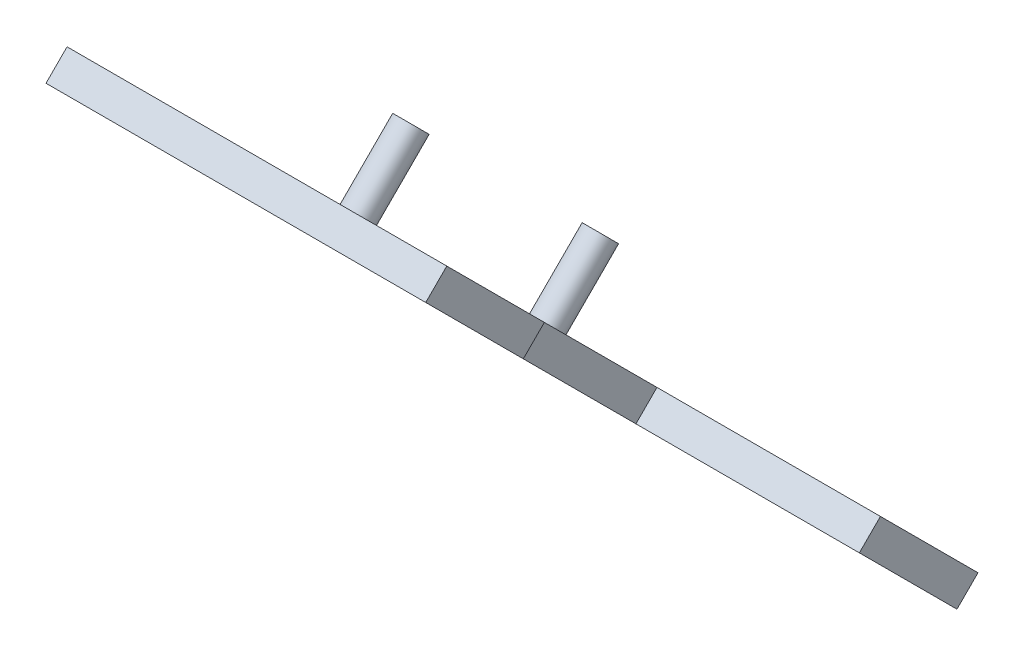
ISO-10303-21;
HEADER;
FILE_DESCRIPTION(('STEP AP214'),'2;1');
FILE_NAME('part.step','',(''),(''),'','','');
FILE_SCHEMA(('AUTOMOTIVE_DESIGN { 1 0 10303 214 1 1 1 1 }'));
ENDSEC;
DATA;
#1=APPLICATION_CONTEXT('core data for automotive mechanical design processes');
#2=APPLICATION_PROTOCOL_DEFINITION('international standard','automotive_design',2000,#1);
#3=PRODUCT_CONTEXT('',#1,'mechanical');
#4=PRODUCT('Part','Part','',(#3));
#5=PRODUCT_RELATED_PRODUCT_CATEGORY('part','',(#4));
#6=PRODUCT_DEFINITION_FORMATION('','',#4);
#7=PRODUCT_DEFINITION_CONTEXT('part definition',#1,'design');
#8=PRODUCT_DEFINITION('design','',#6,#7);
#9=PRODUCT_DEFINITION_SHAPE('','',#8);
#10=(LENGTH_UNIT() NAMED_UNIT(*) SI_UNIT(.MILLI.,.METRE.));
#11=(NAMED_UNIT(*) PLANE_ANGLE_UNIT() SI_UNIT($,.RADIAN.));
#12=(NAMED_UNIT(*) SI_UNIT($,.STERADIAN.) SOLID_ANGLE_UNIT());
#13=UNCERTAINTY_MEASURE_WITH_UNIT(LENGTH_MEASURE(1.E-05),#10,'distance_accuracy_value','');
#14=(GEOMETRIC_REPRESENTATION_CONTEXT(3) GLOBAL_UNCERTAINTY_ASSIGNED_CONTEXT((#13)) GLOBAL_UNIT_ASSIGNED_CONTEXT((#10,
#11,#12)) REPRESENTATION_CONTEXT('',''));
#15=CARTESIAN_POINT('',(0.,0.,0.));
#16=DIRECTION('',(0.,0.,1.));
#17=DIRECTION('',(1.,0.,0.));
#18=AXIS2_PLACEMENT_3D('',#15,#16,#17);
#19=CARTESIAN_POINT('',(-23105.,0.,0.));
#20=DIRECTION('',(1.,0.,0.));
#21=DIRECTION('',(0.,0.,-1.));
#22=AXIS2_PLACEMENT_3D('',#19,#20,#21);
#23=PLANE('',#22);
#24=DIRECTION('',(0.,-0.707106781186514,0.707106781186581));
#25=VECTOR('',#24,1.);
#26=CARTESIAN_POINT('',(-23105.,2719.70909353259,40124.3472603107));
#27=LINE('',#26,#25);
#28=CARTESIAN_POINT('',(-23105.,2719.70909353259,40124.3472603107));
#29=VERTEX_POINT('',#28);
#30=CARTESIAN_POINT('',(-23105.,2705.56695790886,40138.4893959344));
#31=VERTEX_POINT('',#30);
#32=EDGE_CURVE('E106',#29,#31,#27,.T.);
#33=ORIENTED_EDGE('',*,*,#32,.F.);
#34=DIRECTION('',(0.,-0.707106781186554,-0.707106781186542));
#35=VECTOR('',#34,1.);
#36=CARTESIAN_POINT('',(-23105.,-18702.3190833891,18702.3190833894));
#37=LINE('',#36,#35);
#38=CARTESIAN_POINT('',(-23105.,2945.47722462662,40350.1153914047));
#39=VERTEX_POINT('',#38);
#40=EDGE_CURVE('E125',#39,#29,#37,.T.);
#41=ORIENTED_EDGE('',*,*,#40,.F.);
#42=DIRECTION('',(0.,-0.707106781186514,0.707106781186581));
#43=VECTOR('',#42,1.);
#44=CARTESIAN_POINT('',(-23105.,2945.47722462662,40350.1153914047));
#45=LINE('',#44,#43);
#46=CARTESIAN_POINT('',(-23105.,2931.3350890029,40364.2575270285));
#47=VERTEX_POINT('',#46);
#48=EDGE_CURVE('E124',#39,#47,#45,.T.);
#49=ORIENTED_EDGE('',*,*,#48,.T.);
#50=DIRECTION('',(0.,0.707106781186581,0.707106781186514));
#51=VECTOR('',#50,1.);
#52=CARTESIAN_POINT('',(-23105.,-18716.4612190129,18716.4612190147));
#53=LINE('',#52,#51);
#54=EDGE_CURVE('E54',#31,#47,#53,.T.);
#55=ORIENTED_EDGE('',*,*,#54,.F.);
#56=EDGE_LOOP('',(#33,#41,#49,#55));
#57=FACE_BOUND('',#56,.T.);
#58=ADVANCED_FACE('F39',(#57),#23,.T.);
#59=CARTESIAN_POINT('',(-23105.,21713.3554670348,21713.3554670382));
#60=DIRECTION('',(0.,0.707106781186492,0.707106781186603));
#61=DIRECTION('',(0.,-0.707106781186603,0.707106781186492));
#62=AXIS2_PLACEMENT_3D('',#59,#60,#61);
#63=PLANE('',#62);
#64=DIRECTION('',(-1.,0.,0.));
#65=VECTOR('',#64,1.);
#66=CARTESIAN_POINT('',(-23105.,3011.03638364598,40415.6745504241));
#67=LINE('',#66,#65);
#68=CARTESIAN_POINT('',(-22954.8819480886,3011.03638364597,40415.6745504241));
#69=VERTEX_POINT('',#68);
#70=CARTESIAN_POINT('',(-23210.,3011.03638364598,40415.6745504241));
#71=VERTEX_POINT('',#70);
#72=EDGE_CURVE('E62',#69,#71,#67,.T.);
#73=ORIENTED_EDGE('',*,*,#72,.T.);
#74=DIRECTION('',(0.,0.707106781186603,-0.707106781186492));
#75=VECTOR('',#74,1.);
#76=CARTESIAN_POINT('',(-23210.,21713.3554670348,21713.3554670382));
#77=LINE('',#76,#75);
#78=CARTESIAN_POINT('',(-23210.,2996.89424802225,40429.8166860478));
#79=VERTEX_POINT('',#78);
#80=EDGE_CURVE('E150',#79,#71,#77,.T.);
#81=ORIENTED_EDGE('',*,*,#80,.F.);
#82=DIRECTION('',(-1.,0.,0.));
#83=VECTOR('',#82,1.);
#84=CARTESIAN_POINT('',(-23105.,2996.89424802225,40429.8166860478));
#85=LINE('',#84,#83);
#86=CARTESIAN_POINT('',(-22954.8819480886,2996.89424802224,40429.8166860478));
#87=VERTEX_POINT('',#86);
#88=EDGE_CURVE('E11',#87,#79,#85,.T.);
#89=ORIENTED_EDGE('',*,*,#88,.F.);
#90=DIRECTION('',(0.,-0.707106781186514,0.707106781186581));
#91=VECTOR('',#90,1.);
#92=CARTESIAN_POINT('',(-22954.8819480886,3011.03638364597,40415.6745504241));
#93=LINE('',#92,#91);
#94=EDGE_CURVE('E152',#69,#87,#93,.T.);
#95=ORIENTED_EDGE('',*,*,#94,.F.);
#96=EDGE_LOOP('',(#73,#81,#89,#95));
#97=FACE_BOUND('',#96,.T.);
#98=ADVANCED_FACE('F41',(#97),#63,.T.);
#99=CARTESIAN_POINT('',(-23105.,-18716.4612190129,18716.4612190147));
#100=DIRECTION('',(0.,-0.707106781186514,0.707106781186581));
#101=DIRECTION('',(0.,-0.707106781186581,-0.707106781186514));
#102=AXIS2_PLACEMENT_3D('',#99,#100,#101);
#103=PLANE('',#102);
#104=ORIENTED_EDGE('',*,*,#88,.T.);
#105=DIRECTION('',(0.,0.707106781186581,0.707106781186514));
#106=VECTOR('',#105,1.);
#107=CARTESIAN_POINT('',(-23210.,-18716.4612190129,18716.4612190147));
#108=LINE('',#107,#106);
#109=CARTESIAN_POINT('',(-23210.,2640.00779888953,40072.9302369151));
#110=VERTEX_POINT('',#109);
#111=EDGE_CURVE('E148',#110,#79,#108,.T.);
#112=ORIENTED_EDGE('',*,*,#111,.F.);
#113=DIRECTION('',(-1.,0.,0.));
#114=VECTOR('',#113,1.);
#115=CARTESIAN_POINT('',(-23105.,2640.00779888953,40072.9302369151));
#116=LINE('',#115,#114);
#117=CARTESIAN_POINT('',(-22954.8819480886,2640.00779888951,40072.9302369151));
#118=VERTEX_POINT('',#117);
#119=EDGE_CURVE('E47',#118,#110,#116,.T.);
#120=ORIENTED_EDGE('',*,*,#119,.F.);
#121=DIRECTION('',(0.,0.707106781186567,0.707106781186528));
#122=VECTOR('',#121,1.);
#123=CARTESIAN_POINT('',(-22954.8819480886,2705.56695790886,40138.4893959344));
#124=LINE('',#123,#122);
#125=CARTESIAN_POINT('',(-22954.8819480886,2705.56695790886,40138.4893959344));
#126=VERTEX_POINT('',#125);
#127=EDGE_CURVE('E120',#118,#126,#124,.T.);
#128=ORIENTED_EDGE('',*,*,#127,.T.);
#129=DIRECTION('',(-1.,0.,0.));
#130=VECTOR('',#129,1.);
#131=CARTESIAN_POINT('',(-23105.,2705.56695790886,40138.4893959344));
#132=LINE('',#131,#130);
#133=EDGE_CURVE('E108',#126,#31,#132,.T.);
#134=ORIENTED_EDGE('',*,*,#133,.T.);
#135=ORIENTED_EDGE('',*,*,#54,.T.);
#136=DIRECTION('',(1.,0.,0.));
#137=VECTOR('',#136,1.);
#138=CARTESIAN_POINT('',(-23105.,2931.33508900289,40364.2575270285));
#139=LINE('',#138,#137);
#140=CARTESIAN_POINT('',(-22954.8819480886,2931.33508900289,40364.2575270285));
#141=VERTEX_POINT('',#140);
#142=EDGE_CURVE('E164',#47,#141,#139,.T.);
#143=ORIENTED_EDGE('',*,*,#142,.T.);
#144=DIRECTION('',(0.,0.707106781186605,0.70710678118649));
#145=VECTOR('',#144,1.);
#146=CARTESIAN_POINT('',(-22954.8819480886,2996.89424802224,40429.8166860478));
#147=LINE('',#146,#145);
#148=EDGE_CURVE('E161',#141,#87,#147,.T.);
#149=ORIENTED_EDGE('',*,*,#148,.T.);
#150=EDGE_LOOP('',(#104,#112,#120,#128,#134,#135,#143,#149));
#151=FACE_BOUND('',#150,.T.);
#152=ADVANCED_FACE('F118',(#151),#103,.T.);
#153=CARTESIAN_POINT('',(-23105.,21356.4690179023,21356.4690179029));
#154=DIRECTION('',(0.,-0.707106781186536,-0.707106781186559));
#155=DIRECTION('',(0.,0.707106781186559,-0.707106781186536));
#156=AXIS2_PLACEMENT_3D('',#153,#154,#155);
#157=PLANE('',#156);
#158=ORIENTED_EDGE('',*,*,#119,.T.);
#159=DIRECTION('',(0.,-0.707106781186559,0.707106781186536));
#160=VECTOR('',#159,1.);
#161=CARTESIAN_POINT('',(-23210.,21356.4690179023,21356.4690179029));
#162=LINE('',#161,#160);
#163=CARTESIAN_POINT('',(-23210.,2654.14993451326,40058.7881012914));
#164=VERTEX_POINT('',#163);
#165=EDGE_CURVE('E130',#164,#110,#162,.T.);
#166=ORIENTED_EDGE('',*,*,#165,.F.);
#167=DIRECTION('',(-1.,0.,0.));
#168=VECTOR('',#167,1.);
#169=CARTESIAN_POINT('',(-23105.,2654.14993451326,40058.7881012914));
#170=LINE('',#169,#168);
#171=CARTESIAN_POINT('',(-22954.8819480886,2654.14993451324,40058.7881012914));
#172=VERTEX_POINT('',#171);
#173=EDGE_CURVE('E135',#172,#164,#170,.T.);
#174=ORIENTED_EDGE('',*,*,#173,.F.);
#175=DIRECTION('',(0.,-0.707106781186514,0.707106781186581));
#176=VECTOR('',#175,1.);
#177=CARTESIAN_POINT('',(-22954.8819480886,2654.14993451324,40058.7881012914));
#178=LINE('',#177,#176);
#179=EDGE_CURVE('E142',#172,#118,#178,.T.);
#180=ORIENTED_EDGE('',*,*,#179,.T.);
#181=EDGE_LOOP('',(#158,#166,#174,#180));
#182=FACE_BOUND('',#181,.T.);
#183=ADVANCED_FACE('F140',(#182),#157,.T.);
#184=CARTESIAN_POINT('',(-23105.,-18702.3190833891,18702.3190833894));
#185=DIRECTION('',(0.,0.707106781186542,-0.707106781186553));
#186=DIRECTION('',(0.,0.707106781186553,0.707106781186542));
#187=AXIS2_PLACEMENT_3D('',#184,#185,#186);
#188=PLANE('',#187);
#189=CARTESIAN_POINT('',(-23146.2304490389,2879.14180176871,40283.7799685468));
#190=DIRECTION('',(0.,0.707106781186542,-0.707106781186553));
#191=DIRECTION('',(0.,0.707106781186553,0.707106781186542));
#192=AXIS2_PLACEMENT_3D('',#189,#190,#191);
#193=CIRCLE('',#192,10.0000000000037);
#194=CARTESIAN_POINT('',(-23146.2304490389,2886.21286958058,40290.8510363587));
#195=VERTEX_POINT('',#194);
#196=EDGE_CURVE('E179',#195,#195,#193,.T.);
#197=ORIENTED_EDGE('',*,*,#196,.F.);
#198=EDGE_LOOP('',(#197));
#199=FACE_BOUND('',#198,.T.);
#200=CARTESIAN_POINT('',(-23146.230449039,2751.86258115513,40156.5007479332));
#201=DIRECTION('',(0.,0.707106781186542,-0.707106781186553));
#202=DIRECTION('',(0.,0.707106781186553,0.707106781186542));
#203=AXIS2_PLACEMENT_3D('',#200,#201,#202);
#204=CIRCLE('',#203,10.0000000000037);
#205=CARTESIAN_POINT('',(-23146.230449039,2758.933648967,40163.5718157451));
#206=VERTEX_POINT('',#205);
#207=EDGE_CURVE('E176',#206,#206,#204,.T.);
#208=ORIENTED_EDGE('',*,*,#207,.F.);
#209=EDGE_LOOP('',(#208));
#210=FACE_BOUND('',#209,.T.);
#211=ORIENTED_EDGE('',*,*,#173,.T.);
#212=DIRECTION('',(0.,-0.707106781186554,-0.707106781186542));
#213=VECTOR('',#212,1.);
#214=CARTESIAN_POINT('',(-23210.,-18702.3190833891,18702.3190833894));
#215=LINE('',#214,#213);
#216=EDGE_CURVE('E126',#71,#164,#215,.T.);
#217=ORIENTED_EDGE('',*,*,#216,.F.);
#218=ORIENTED_EDGE('',*,*,#72,.F.);
#219=DIRECTION('',(0.,0.707106781186605,0.70710678118649));
#220=VECTOR('',#219,1.);
#221=CARTESIAN_POINT('',(-22954.8819480886,3011.03638364597,40415.6745504241));
#222=LINE('',#221,#220);
#223=CARTESIAN_POINT('',(-22954.8819480886,2945.47722462662,40350.1153914047));
#224=VERTEX_POINT('',#223);
#225=EDGE_CURVE('E157',#224,#69,#222,.T.);
#226=ORIENTED_EDGE('',*,*,#225,.F.);
#227=DIRECTION('',(1.,0.,0.));
#228=VECTOR('',#227,1.);
#229=CARTESIAN_POINT('',(-23105.,2945.47722462662,40350.1153914047));
#230=LINE('',#229,#228);
#231=EDGE_CURVE('E163',#39,#224,#230,.T.);
#232=ORIENTED_EDGE('',*,*,#231,.F.);
#233=ORIENTED_EDGE('',*,*,#40,.T.);
#234=DIRECTION('',(-1.,0.,0.));
#235=VECTOR('',#234,1.);
#236=CARTESIAN_POINT('',(-23105.,2719.70909353259,40124.3472603107));
#237=LINE('',#236,#235);
#238=CARTESIAN_POINT('',(-22954.8819480886,2719.70909353259,40124.3472603107));
#239=VERTEX_POINT('',#238);
#240=EDGE_CURVE('E110',#239,#29,#237,.T.);
#241=ORIENTED_EDGE('',*,*,#240,.F.);
#242=DIRECTION('',(0.,0.707106781186567,0.707106781186528));
#243=VECTOR('',#242,1.);
#244=CARTESIAN_POINT('',(-22954.8819480886,2719.70909353259,40124.3472603107));
#245=LINE('',#244,#243);
#246=EDGE_CURVE('E121',#172,#239,#245,.T.);
#247=ORIENTED_EDGE('',*,*,#246,.F.);
#248=EDGE_LOOP('',(#211,#217,#218,#226,#232,#233,#241,#247));
#249=FACE_BOUND('',#248,.T.);
#250=ADVANCED_FACE('F190',(#199,#210,#249),#188,.T.);
#251=CARTESIAN_POINT('',(-23210.,0.,0.));
#252=DIRECTION('',(1.,0.,0.));
#253=DIRECTION('',(0.,0.,-1.));
#254=AXIS2_PLACEMENT_3D('',#251,#252,#253);
#255=PLANE('',#254);
#256=ORIENTED_EDGE('',*,*,#80,.T.);
#257=ORIENTED_EDGE('',*,*,#216,.T.);
#258=ORIENTED_EDGE('',*,*,#165,.T.);
#259=ORIENTED_EDGE('',*,*,#111,.T.);
#260=EDGE_LOOP('',(#256,#257,#258,#259));
#261=FACE_BOUND('',#260,.T.);
#262=ADVANCED_FACE('F147',(#261),#255,.F.);
#263=CARTESIAN_POINT('',(-22954.8819480886,3011.03638364597,40415.6745504241));
#264=DIRECTION('',(1.,0.,0.));
#265=DIRECTION('',(0.,0.,-1.));
#266=AXIS2_PLACEMENT_3D('',#263,#264,#265);
#267=PLANE('',#266);
#268=ORIENTED_EDGE('',*,*,#148,.F.);
#269=DIRECTION('',(0.,-0.707106781186514,0.707106781186581));
#270=VECTOR('',#269,1.);
#271=CARTESIAN_POINT('',(-22954.8819480886,2945.47722462662,40350.1153914047));
#272=LINE('',#271,#270);
#273=EDGE_CURVE('E156',#224,#141,#272,.T.);
#274=ORIENTED_EDGE('',*,*,#273,.F.);
#275=ORIENTED_EDGE('',*,*,#225,.T.);
#276=ORIENTED_EDGE('',*,*,#94,.T.);
#277=EDGE_LOOP('',(#268,#274,#275,#276));
#278=FACE_BOUND('',#277,.T.);
#279=ADVANCED_FACE('F205',(#278),#267,.T.);
#280=CARTESIAN_POINT('',(-23105.,2945.47722462662,40350.1153914047));
#281=DIRECTION('',(0.,-0.707106781186581,-0.707106781186514));
#282=DIRECTION('',(0.,0.707106781186514,-0.707106781186581));
#283=AXIS2_PLACEMENT_3D('',#280,#281,#282);
#284=PLANE('',#283);
#285=ORIENTED_EDGE('',*,*,#142,.F.);
#286=ORIENTED_EDGE('',*,*,#48,.F.);
#287=ORIENTED_EDGE('',*,*,#231,.T.);
#288=ORIENTED_EDGE('',*,*,#273,.T.);
#289=EDGE_LOOP('',(#285,#286,#287,#288));
#290=FACE_BOUND('',#289,.T.);
#291=ADVANCED_FACE('F202',(#290),#284,.T.);
#292=CARTESIAN_POINT('',(-23105.,2719.70909353259,40124.3472603107));
#293=DIRECTION('',(0.,0.707106781186581,0.707106781186514));
#294=DIRECTION('',(0.,-0.707106781186514,0.707106781186581));
#295=AXIS2_PLACEMENT_3D('',#292,#293,#294);
#296=PLANE('',#295);
#297=ORIENTED_EDGE('',*,*,#133,.F.);
#298=DIRECTION('',(0.,-0.707106781186514,0.707106781186581));
#299=VECTOR('',#298,1.);
#300=CARTESIAN_POINT('',(-22954.8819480886,2719.70909353259,40124.3472603107));
#301=LINE('',#300,#299);
#302=EDGE_CURVE('E114',#239,#126,#301,.T.);
#303=ORIENTED_EDGE('',*,*,#302,.F.);
#304=ORIENTED_EDGE('',*,*,#240,.T.);
#305=ORIENTED_EDGE('',*,*,#32,.T.);
#306=EDGE_LOOP('',(#297,#303,#304,#305));
#307=FACE_BOUND('',#306,.T.);
#308=ADVANCED_FACE('F107',(#307),#296,.T.);
#309=CARTESIAN_POINT('',(-22954.8819480886,2719.70909353259,40124.3472603107));
#310=DIRECTION('',(1.,0.,0.));
#311=DIRECTION('',(0.,0.,-1.));
#312=AXIS2_PLACEMENT_3D('',#309,#310,#311);
#313=PLANE('',#312);
#314=ORIENTED_EDGE('',*,*,#127,.F.);
#315=ORIENTED_EDGE('',*,*,#179,.F.);
#316=ORIENTED_EDGE('',*,*,#246,.T.);
#317=ORIENTED_EDGE('',*,*,#302,.T.);
#318=EDGE_LOOP('',(#314,#315,#316,#317));
#319=FACE_BOUND('',#318,.T.);
#320=ADVANCED_FACE('F198',(#319),#313,.T.);
#321=CARTESIAN_POINT('',(-23146.230449039,2787.21792021446,40121.1454088739));
#322=DIRECTION('',(0.,-0.707106781186542,0.707106781186553));
#323=DIRECTION('',(0.,-0.707106781186553,-0.707106781186542));
#324=AXIS2_PLACEMENT_3D('',#321,#322,#323);
#325=CYLINDRICAL_SURFACE('',#324,10.0000000000037);
#326=CARTESIAN_POINT('',(-23146.230449039,2787.21792021446,40121.1454088739));
#327=DIRECTION('',(0.,0.707106781186542,-0.707106781186553));
#328=DIRECTION('',(0.,0.707106781186553,0.707106781186542));
#329=AXIS2_PLACEMENT_3D('',#326,#327,#328);
#330=CIRCLE('',#329,10.0000000000037);
#331=CARTESIAN_POINT('',(-23146.230449039,2794.28898802633,40128.2164766858));
#332=VERTEX_POINT('',#331);
#333=EDGE_CURVE('E115',#332,#332,#330,.T.);
#334=ORIENTED_EDGE('',*,*,#333,.F.);
#335=EDGE_LOOP('',(#334));
#336=FACE_BOUND('',#335,.T.);
#337=ORIENTED_EDGE('',*,*,#207,.T.);
#338=EDGE_LOOP('',(#337));
#339=FACE_BOUND('',#338,.T.);
#340=ADVANCED_FACE('F255',(#336,#339),#325,.T.);
#341=CARTESIAN_POINT('',(-23146.230449039,2787.21792021446,40121.1454088739));
#342=DIRECTION('',(0.,0.707106781186542,-0.707106781186553));
#343=DIRECTION('',(0.,0.707106781186553,0.707106781186542));
#344=AXIS2_PLACEMENT_3D('',#341,#342,#343);
#345=PLANE('',#344);
#346=ORIENTED_EDGE('',*,*,#333,.T.);
#347=EDGE_LOOP('',(#346));
#348=FACE_BOUND('',#347,.T.);
#349=ADVANCED_FACE('F261',(#348),#345,.T.);
#350=CARTESIAN_POINT('',(-23146.2304490389,2914.49714082803,40248.4246294875));
#351=DIRECTION('',(0.,-0.707106781186542,0.707106781186553));
#352=DIRECTION('',(0.,-0.707106781186553,-0.707106781186542));
#353=AXIS2_PLACEMENT_3D('',#350,#351,#352);
#354=CYLINDRICAL_SURFACE('',#353,10.0000000000037);
#355=CARTESIAN_POINT('',(-23146.2304490389,2914.49714082803,40248.4246294875));
#356=DIRECTION('',(0.,0.707106781186542,-0.707106781186553));
#357=DIRECTION('',(0.,0.707106781186553,0.707106781186542));
#358=AXIS2_PLACEMENT_3D('',#355,#356,#357);
#359=CIRCLE('',#358,10.0000000000037);
#360=CARTESIAN_POINT('',(-23146.2304490389,2921.5682086399,40255.4956972993));
#361=VERTEX_POINT('',#360);
#362=EDGE_CURVE('E182',#361,#361,#359,.T.);
#363=ORIENTED_EDGE('',*,*,#362,.F.);
#364=EDGE_LOOP('',(#363));
#365=FACE_BOUND('',#364,.T.);
#366=ORIENTED_EDGE('',*,*,#196,.T.);
#367=EDGE_LOOP('',(#366));
#368=FACE_BOUND('',#367,.T.);
#369=ADVANCED_FACE('F188',(#365,#368),#354,.T.);
#370=CARTESIAN_POINT('',(-23146.2304490389,2914.49714082803,40248.4246294875));
#371=DIRECTION('',(0.,0.707106781186542,-0.707106781186553));
#372=DIRECTION('',(0.,0.707106781186553,0.707106781186542));
#373=AXIS2_PLACEMENT_3D('',#370,#371,#372);
#374=PLANE('',#373);
#375=ORIENTED_EDGE('',*,*,#362,.T.);
#376=EDGE_LOOP('',(#375));
#377=FACE_BOUND('',#376,.T.);
#378=ADVANCED_FACE('F276',(#377),#374,.T.);
#379=CLOSED_SHELL('',(#58,#98,#152,#183,#250,#262,#279,#291,#308,#320,#340,#349,#369,#378));
#380=MANIFOLD_SOLID_BREP('B2',#379);
#381=ADVANCED_BREP_SHAPE_REPRESENTATION('',(#18,#380),#14);
#382=SHAPE_DEFINITION_REPRESENTATION(#9,#381);
ENDSEC;
END-ISO-10303-21;
